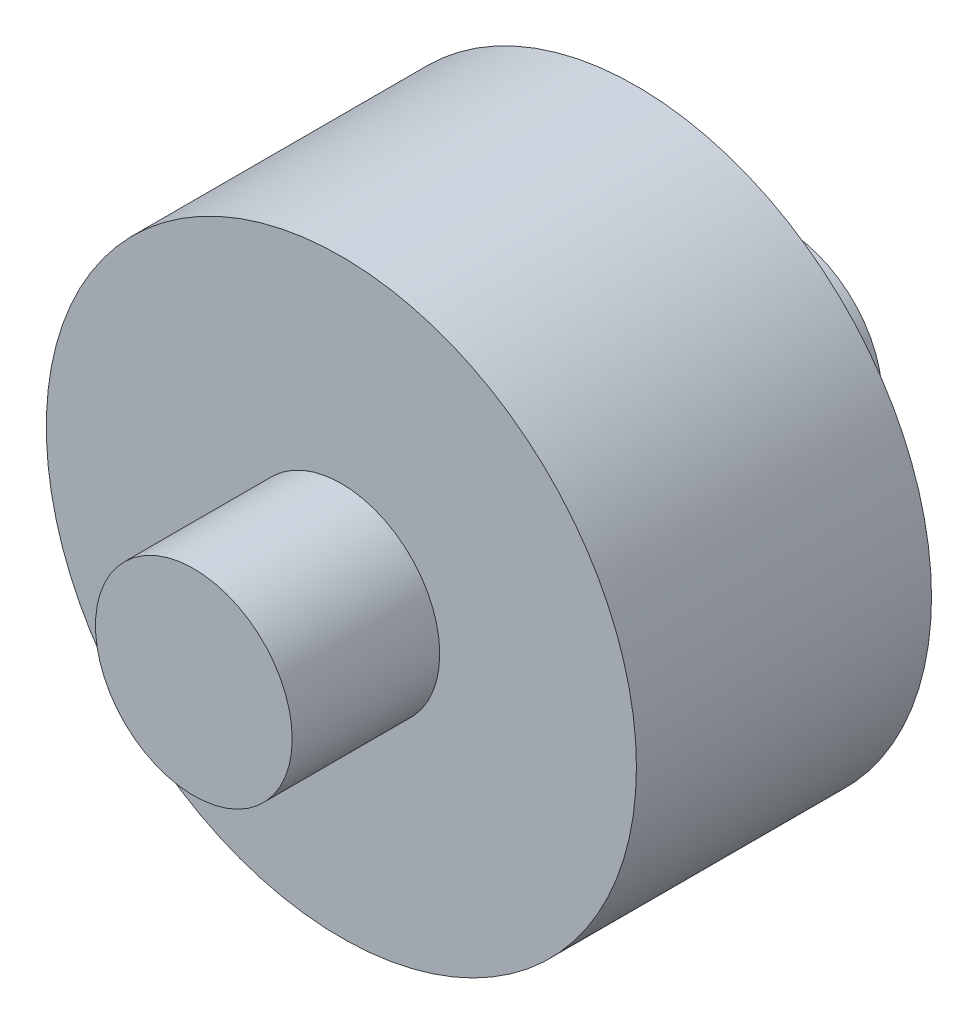
ISO-10303-21;
HEADER;
FILE_DESCRIPTION(('STEP AP214'),'2;1');
FILE_NAME('part.step','',(''),(''),'','','');
FILE_SCHEMA(('AUTOMOTIVE_DESIGN { 1 0 10303 214 1 1 1 1 }'));
ENDSEC;
DATA;
#1=APPLICATION_CONTEXT('core data for automotive mechanical design processes');
#2=APPLICATION_PROTOCOL_DEFINITION('international standard','automotive_design',2000,#1);
#3=PRODUCT_CONTEXT('',#1,'mechanical');
#4=PRODUCT('Part','Part','',(#3));
#5=PRODUCT_RELATED_PRODUCT_CATEGORY('part','',(#4));
#6=PRODUCT_DEFINITION_FORMATION('','',#4);
#7=PRODUCT_DEFINITION_CONTEXT('part definition',#1,'design');
#8=PRODUCT_DEFINITION('design','',#6,#7);
#9=PRODUCT_DEFINITION_SHAPE('','',#8);
#10=(LENGTH_UNIT() NAMED_UNIT(*) SI_UNIT(.MILLI.,.METRE.));
#11=(NAMED_UNIT(*) PLANE_ANGLE_UNIT() SI_UNIT($,.RADIAN.));
#12=(NAMED_UNIT(*) SI_UNIT($,.STERADIAN.) SOLID_ANGLE_UNIT());
#13=UNCERTAINTY_MEASURE_WITH_UNIT(LENGTH_MEASURE(1.E-05),#10,'distance_accuracy_value','');
#14=(GEOMETRIC_REPRESENTATION_CONTEXT(3) GLOBAL_UNCERTAINTY_ASSIGNED_CONTEXT((#13)) GLOBAL_UNIT_ASSIGNED_CONTEXT((#10,
#11,#12)) REPRESENTATION_CONTEXT('',''));
#15=CARTESIAN_POINT('',(0.,0.,0.));
#16=DIRECTION('',(0.,0.,1.));
#17=DIRECTION('',(1.,0.,0.));
#18=AXIS2_PLACEMENT_3D('',#15,#16,#17);
#19=CARTESIAN_POINT('',(0.,0.,4.7625));
#20=DIRECTION('',(0.,0.,-1.));
#21=DIRECTION('',(-1.,0.,0.));
#22=AXIS2_PLACEMENT_3D('',#19,#20,#21);
#23=CYLINDRICAL_SURFACE('',#22,9.525);
#24=CARTESIAN_POINT('',(-9.525,0.,-3.175));
#25=CARTESIAN_POINT('',(-9.52500048580498,0.173238677165346,-3.17500080559796));
#26=CARTESIAN_POINT('',(-9.52023018186455,0.346472492659896,-3.16077515504609));
#27=CARTESIAN_POINT('',(-9.50167042395416,0.687837590771687,-3.10442257950533));
#28=CARTESIAN_POINT('',(-9.48788003366834,0.855968341777246,-3.06229275796217));
#29=CARTESIAN_POINT('',(-9.45277852602955,1.18215660666814,-2.95173640225565));
#30=CARTESIAN_POINT('',(-9.43147998545459,1.34023044718816,-2.88335382669181));
#31=CARTESIAN_POINT('',(-9.3835361515256,1.64266542435691,-2.72243177623825));
#32=CARTESIAN_POINT('',(-9.35688980370195,1.78702384834389,-2.62988753611674));
#33=CARTESIAN_POINT('',(-9.30002249856541,2.0629298181957,-2.41990306957346));
#34=CARTESIAN_POINT('',(-9.26971591772517,2.19393674844713,-2.30177583122293));
#35=CARTESIAN_POINT('',(-9.2094149943641,2.43469379932912,-2.04543928380665));
#36=CARTESIAN_POINT('',(-9.17942072197493,2.54443923892904,-1.90722556410197));
#37=CARTESIAN_POINT('',(-9.12219830615344,2.74264419157345,-1.60977225925124));
#38=CARTESIAN_POINT('',(-9.0950744970031,2.83040092485178,-1.45004237635051));
#39=CARTESIAN_POINT('',(-9.04796594704058,2.97757492456177,-1.11704090009411));
#40=CARTESIAN_POINT('',(-9.02797902810367,3.03700083920298,-0.943773458008288));
#41=CARTESIAN_POINT('',(-8.99830887880273,3.12379824029159,-0.594762521747945));
#42=CARTESIAN_POINT('',(-8.98830104068516,3.15218269826287,-0.41929936304722));
#43=CARTESIAN_POINT('',(-8.97876209798686,3.17925806658696,-0.065837580555078));
#44=CARTESIAN_POINT('',(-8.97922775597168,3.17795815259498,0.11216024275168));
#45=CARTESIAN_POINT('',(-8.99029872650972,3.14648819425835,0.456998801659767));
#46=CARTESIAN_POINT('',(-9.00043970379417,3.11764017430521,0.623977679267884));
#47=CARTESIAN_POINT('',(-9.02895888275449,3.0340495670469,0.9505741072517));
#48=CARTESIAN_POINT('',(-9.04733807064542,2.97930387942919,1.11019077375635));
#49=CARTESIAN_POINT('',(-9.09059367841715,2.84460650934117,1.42053547995295));
#50=CARTESIAN_POINT('',(-9.11556996393148,2.76426310464556,1.57107898086574));
#51=CARTESIAN_POINT('',(-9.16916373477931,2.58092291251247,1.85696513378813));
#52=CARTESIAN_POINT('',(-9.19778227084722,2.47791958175572,1.99230337801349));
#53=CARTESIAN_POINT('',(-9.25726270107577,2.2458341312661,2.25136582416045));
#54=CARTESIAN_POINT('',(-9.28816371201626,2.11567125149229,2.3741148050663));
#55=CARTESIAN_POINT('',(-9.34742029378842,1.83622813465495,2.59629677165629));
#56=CARTESIAN_POINT('',(-9.37577562033364,1.68694606622309,2.69572752117227));
#57=CARTESIAN_POINT('',(-9.42711817702495,1.3714336714219,2.86923575324634));
#58=CARTESIAN_POINT('',(-9.45004936275525,1.20504990262187,2.94305193500682));
#59=CARTESIAN_POINT('',(-9.4875530068358,0.86127933968231,3.06134507730938));
#60=CARTESIAN_POINT('',(-9.50212836854242,0.683896391141976,3.10583222946941));
#61=CARTESIAN_POINT('',(-9.52079715951823,0.331418658755539,3.16247673962099));
#62=CARTESIAN_POINT('',(-9.52531755822087,0.156557979570885,3.17595189412348));
#63=CARTESIAN_POINT('',(-9.52464766056077,-0.192960847123755,3.17394376132486));
#64=CARTESIAN_POINT('',(-9.51945900331475,-0.367619023839891,3.15846536206389));
#65=CARTESIAN_POINT('',(-9.50023578476806,-0.706500575516013,3.10003219293833));
#66=CARTESIAN_POINT('',(-9.48646180908036,-0.870879661700629,3.05788629579285));
#67=CARTESIAN_POINT('',(-9.45171613685472,-1.19016766849015,2.94832581381814));
#68=CARTESIAN_POINT('',(-9.43074352248193,-1.34507537851483,2.88090800668978));
#69=CARTESIAN_POINT('',(-9.38304356837145,-1.64556534104864,2.7207513789055));
#70=CARTESIAN_POINT('',(-9.35617936849621,-1.79079512051444,2.62739316632593));
#71=CARTESIAN_POINT('',(-9.29974181184133,-2.06395583568049,2.41873357370719));
#72=CARTESIAN_POINT('',(-9.27016762910402,-2.19188146775096,2.30342549209915));
#73=CARTESIAN_POINT('',(-9.20993992337912,-2.432851712285,2.04794246555408));
#74=CARTESIAN_POINT('',(-9.17929841452584,-2.54495607735532,1.90687570450722));
#75=CARTESIAN_POINT('',(-9.121774152107,-2.74401763337735,1.60727527220043));
#76=CARTESIAN_POINT('',(-9.09489142987857,-2.83097461468097,1.44874145533681));
#77=CARTESIAN_POINT('',(-9.04819093937643,-2.97687025407195,1.11863817645458));
#78=CARTESIAN_POINT('',(-9.02835890517708,-3.03586556962394,0.947095898639168));
#79=CARTESIAN_POINT('',(-8.99829392572977,-3.12386556696095,0.595697786109885));
#80=CARTESIAN_POINT('',(-8.98805665630055,-3.15288375947876,0.41584573484119));
#81=CARTESIAN_POINT('',(-8.97883201925513,-3.17905219686556,0.0628742200700907));
#82=CARTESIAN_POINT('',(-8.97929370817293,-3.17776306695417,-0.110116430410664));
#83=CARTESIAN_POINT('',(-8.99005281690779,-3.1471942816996,-0.453279112877548));
#84=CARTESIAN_POINT('',(-9.00034965132723,-3.11791629228101,-0.623451312007406));
#85=CARTESIAN_POINT('',(-9.02920864668031,-3.03330550668567,-0.95293073003285));
#86=CARTESIAN_POINT('',(-9.04761011221366,-2.97847812359926,-1.11238291938928));
#87=CARTESIAN_POINT('',(-9.09054566248638,-2.8447344862872,-1.419947017029));
#88=CARTESIAN_POINT('',(-9.11508110823773,-2.76581288515833,-1.56805639902192));
#89=CARTESIAN_POINT('',(-9.16885482792697,-2.58210269895239,-1.85573565200524));
#90=CARTESIAN_POINT('',(-9.19825159463785,-2.47633567077754,-1.99465089352738));
#91=CARTESIAN_POINT('',(-9.25777156199328,-2.24359115395568,-2.25326515749484));
#92=CARTESIAN_POINT('',(-9.28789496596782,-2.11660766813345,-2.37295872780964));
#93=CARTESIAN_POINT('',(-9.34688346918603,-1.83909194322318,-2.59443350901814));
#94=CARTESIAN_POINT('',(-9.3756537721899,-1.68783480536164,-2.69533480410942));
#95=CARTESIAN_POINT('',(-9.42740021973043,-1.36955960976603,-2.8701696116008));
#96=CARTESIAN_POINT('',(-9.45037784507677,-1.20254559507021,-2.94411001830248));
#97=CARTESIAN_POINT('',(-9.4870751034262,-0.865167329863098,-3.05981618315153));
#98=CARTESIAN_POINT('',(-9.50116249441509,-0.695286130622598,-3.10287183038622));
#99=CARTESIAN_POINT('',(-9.52012342428904,-0.350267320832534,-3.16045939114988));
#100=CARTESIAN_POINT('',(-9.52499950888798,-0.17513117618077,-3.1749991856015));
#101=CARTESIAN_POINT('',(-9.525,0.,-3.175));
#102=B_SPLINE_CURVE_WITH_KNOTS('',3,(#24,#25,#26,#27,#28,#29,#30,#31,#32,#33,#34,#35,#36,#37,
#38,#39,#40,#41,#42,#43,#44,#45,#46,#47,#48,#49,#50,#51,#52,#53,#54,#55,#56,#57,#58,#59,#60,#61,
#62,#63,#64,#65,#66,#67,#68,#69,#70,#71,#72,#73,#74,#75,#76,#77,#78,#79,#80,#81,#82,#83,#84,#85,
#86,#87,#88,#89,#90,#91,#92,#93,#94,#95,#96,#97,#98,#99,#100,#101),.UNSPECIFIED.,.T.,.F.,(4,2,2,
2,2,2,2,2,2,2,2,2,2,2,2,2,2,2,2,2,2,2,2,2,2,2,2,2,2,2,2,2,2,2,2,2,2,2,4),(0.,0.519071561632585,
1.03819701322438,1.55645698636312,2.07481924951214,2.6093637259775,3.14402575687908,
3.69406121814519,4.24392866899746,4.77526114230342,5.30642937910266,5.81332424300315,
6.32027980466155,6.8353994341754,7.35066800622308,7.8928374595109,8.43505888444013,
8.98265937939885,9.53006948685136,10.0537512658116,10.5773446429626,11.0857715158083,
11.5942632377703,12.1161301950386,12.638156741095,13.1839024764639,13.7296527614611,
14.274292439,14.8186865394104,15.3351123975402,15.8515075194062,16.3580948898033,
16.8647947620873,17.3936046174648,17.92256420318,18.4721392315144,19.0215736265905,
19.5464607283686,20.0712027467109),.UNSPECIFIED.);
#103=CARTESIAN_POINT('',(-9.525,0.,-3.175));
#104=VERTEX_POINT('',#103);
#105=EDGE_CURVE('E10',#104,#104,#102,.T.);
#106=ORIENTED_EDGE('',*,*,#105,.T.);
#107=EDGE_LOOP('',(#106));
#108=FACE_BOUND('',#107,.T.);
#109=CARTESIAN_POINT('',(0.,0.,4.7625));
#110=DIRECTION('',(0.,0.,1.));
#111=DIRECTION('',(1.,0.,0.));
#112=AXIS2_PLACEMENT_3D('',#109,#110,#111);
#113=CIRCLE('',#112,9.525);
#114=CARTESIAN_POINT('',(9.525,0.,4.7625));
#115=VERTEX_POINT('',#114);
#116=EDGE_CURVE('E46',#115,#115,#113,.T.);
#117=ORIENTED_EDGE('',*,*,#116,.F.);
#118=EDGE_LOOP('',(#117));
#119=FACE_BOUND('',#118,.T.);
#120=CARTESIAN_POINT('',(0.,0.,-4.7625));
#121=DIRECTION('',(0.,0.,1.));
#122=DIRECTION('',(1.,0.,0.));
#123=AXIS2_PLACEMENT_3D('',#120,#121,#122);
#124=CIRCLE('',#123,9.525);
#125=CARTESIAN_POINT('',(9.525,0.,-4.7625));
#126=VERTEX_POINT('',#125);
#127=EDGE_CURVE('E50',#126,#126,#124,.T.);
#128=ORIENTED_EDGE('',*,*,#127,.T.);
#129=EDGE_LOOP('',(#128));
#130=FACE_BOUND('',#129,.T.);
#131=ADVANCED_FACE('F31',(#108,#119,#130),#23,.T.);
#132=CARTESIAN_POINT('',(0.,0.,4.7625));
#133=DIRECTION('',(0.,0.,1.));
#134=DIRECTION('',(1.,0.,0.));
#135=AXIS2_PLACEMENT_3D('',#132,#133,#134);
#136=PLANE('',#135);
#137=CARTESIAN_POINT('',(0.,0.,4.7625));
#138=DIRECTION('',(0.,0.,1.));
#139=DIRECTION('',(1.,0.,0.));
#140=AXIS2_PLACEMENT_3D('',#137,#138,#139);
#141=CIRCLE('',#140,3.175);
#142=CARTESIAN_POINT('',(3.175,0.,4.7625));
#143=VERTEX_POINT('',#142);
#144=EDGE_CURVE('E54',#143,#143,#141,.F.);
#145=ORIENTED_EDGE('',*,*,#144,.T.);
#146=EDGE_LOOP('',(#145));
#147=FACE_BOUND('',#146,.T.);
#148=ORIENTED_EDGE('',*,*,#116,.T.);
#149=EDGE_LOOP('',(#148));
#150=FACE_BOUND('',#149,.T.);
#151=ADVANCED_FACE('F79',(#147,#150),#136,.T.);
#152=CARTESIAN_POINT('',(0.,0.,-4.7625));
#153=DIRECTION('',(0.,0.,1.));
#154=DIRECTION('',(1.,0.,0.));
#155=AXIS2_PLACEMENT_3D('',#152,#153,#154);
#156=PLANE('',#155);
#157=CARTESIAN_POINT('',(0.,0.,-4.7625));
#158=DIRECTION('',(0.,0.,1.));
#159=DIRECTION('',(1.,0.,0.));
#160=AXIS2_PLACEMENT_3D('',#157,#158,#159);
#161=CIRCLE('',#160,3.175);
#162=CARTESIAN_POINT('',(3.175,0.,-4.7625));
#163=VERTEX_POINT('',#162);
#164=EDGE_CURVE('E42',#163,#163,#161,.F.);
#165=ORIENTED_EDGE('',*,*,#164,.F.);
#166=EDGE_LOOP('',(#165));
#167=FACE_BOUND('',#166,.T.);
#168=ORIENTED_EDGE('',*,*,#127,.F.);
#169=EDGE_LOOP('',(#168));
#170=FACE_BOUND('',#169,.T.);
#171=ADVANCED_FACE('F83',(#167,#170),#156,.F.);
#172=CARTESIAN_POINT('',(0.,0.,-9.525));
#173=DIRECTION('',(0.,0.,1.));
#174=DIRECTION('',(1.,0.,0.));
#175=AXIS2_PLACEMENT_3D('',#172,#173,#174);
#176=PLANE('',#175);
#177=CARTESIAN_POINT('',(0.,0.,-9.525));
#178=DIRECTION('',(0.,0.,1.));
#179=DIRECTION('',(1.,0.,0.));
#180=AXIS2_PLACEMENT_3D('',#177,#178,#179);
#181=CIRCLE('',#180,3.175);
#182=CARTESIAN_POINT('',(3.175,0.,-9.525));
#183=VERTEX_POINT('',#182);
#184=EDGE_CURVE('E59',#183,#183,#181,.T.);
#185=ORIENTED_EDGE('',*,*,#184,.F.);
#186=EDGE_LOOP('',(#185));
#187=FACE_BOUND('',#186,.T.);
#188=ADVANCED_FACE('F92',(#187),#176,.F.);
#189=CARTESIAN_POINT('',(0.,0.,9.525));
#190=DIRECTION('',(0.,0.,-1.));
#191=DIRECTION('',(-1.,0.,0.));
#192=AXIS2_PLACEMENT_3D('',#189,#190,#191);
#193=CYLINDRICAL_SURFACE('',#192,3.175);
#194=ORIENTED_EDGE('',*,*,#184,.T.);
#195=EDGE_LOOP('',(#194));
#196=FACE_BOUND('',#195,.T.);
#197=ORIENTED_EDGE('',*,*,#164,.T.);
#198=EDGE_LOOP('',(#197));
#199=FACE_BOUND('',#198,.T.);
#200=ADVANCED_FACE('F97',(#196,#199),#193,.T.);
#201=ORIENTED_EDGE('',*,*,#144,.F.);
#202=EDGE_LOOP('',(#201));
#203=FACE_BOUND('',#202,.T.);
#204=CARTESIAN_POINT('',(0.,0.,9.525));
#205=DIRECTION('',(0.,0.,1.));
#206=DIRECTION('',(1.,0.,0.));
#207=AXIS2_PLACEMENT_3D('',#204,#205,#206);
#208=CIRCLE('',#207,3.175);
#209=CARTESIAN_POINT('',(3.175,0.,9.525));
#210=VERTEX_POINT('',#209);
#211=EDGE_CURVE('E58',#210,#210,#208,.T.);
#212=ORIENTED_EDGE('',*,*,#211,.F.);
#213=EDGE_LOOP('',(#212));
#214=FACE_BOUND('',#213,.T.);
#215=ADVANCED_FACE('F101',(#203,#214),#193,.T.);
#216=CARTESIAN_POINT('',(0.,0.,9.525));
#217=DIRECTION('',(0.,0.,1.));
#218=DIRECTION('',(1.,0.,0.));
#219=AXIS2_PLACEMENT_3D('',#216,#217,#218);
#220=PLANE('',#219);
#221=ORIENTED_EDGE('',*,*,#211,.T.);
#222=EDGE_LOOP('',(#221));
#223=FACE_BOUND('',#222,.T.);
#224=ADVANCED_FACE('F77',(#223),#220,.T.);
#225=CARTESIAN_POINT('',(-9.525,0.,0.));
#226=DIRECTION('',(1.,0.,0.));
#227=DIRECTION('',(0.,0.,-1.));
#228=AXIS2_PLACEMENT_3D('',#225,#226,#227);
#229=CYLINDRICAL_SURFACE('',#228,3.175);
#230=CARTESIAN_POINT('',(0.,0.,0.));
#231=DIRECTION('',(1.,0.,0.));
#232=DIRECTION('',(0.,0.,-1.));
#233=AXIS2_PLACEMENT_3D('',#230,#231,#232);
#234=CIRCLE('',#233,3.175);
#235=CARTESIAN_POINT('',(0.,0.,-3.175));
#236=VERTEX_POINT('',#235);
#237=EDGE_CURVE('E62',#236,#236,#234,.T.);
#238=ORIENTED_EDGE('',*,*,#237,.T.);
#239=EDGE_LOOP('',(#238));
#240=FACE_BOUND('',#239,.T.);
#241=ORIENTED_EDGE('',*,*,#105,.F.);
#242=EDGE_LOOP('',(#241));
#243=FACE_BOUND('',#242,.T.);
#244=ADVANCED_FACE('F68',(#240,#243),#229,.F.);
#245=CARTESIAN_POINT('',(0.,0.,0.));
#246=DIRECTION('',(1.,0.,0.));
#247=DIRECTION('',(0.,0.,-1.));
#248=AXIS2_PLACEMENT_3D('',#245,#246,#247);
#249=PLANE('',#248);
#250=ORIENTED_EDGE('',*,*,#237,.F.);
#251=EDGE_LOOP('',(#250));
#252=FACE_BOUND('',#251,.T.);
#253=ADVANCED_FACE('F71',(#252),#249,.F.);
#254=CLOSED_SHELL('',(#131,#151,#171,#188,#200,#215,#224,#244,#253));
#255=MANIFOLD_SOLID_BREP('B2',#254);
#256=ADVANCED_BREP_SHAPE_REPRESENTATION('',(#18,#255),#14);
#257=SHAPE_DEFINITION_REPRESENTATION(#9,#256);
ENDSEC;
END-ISO-10303-21;
